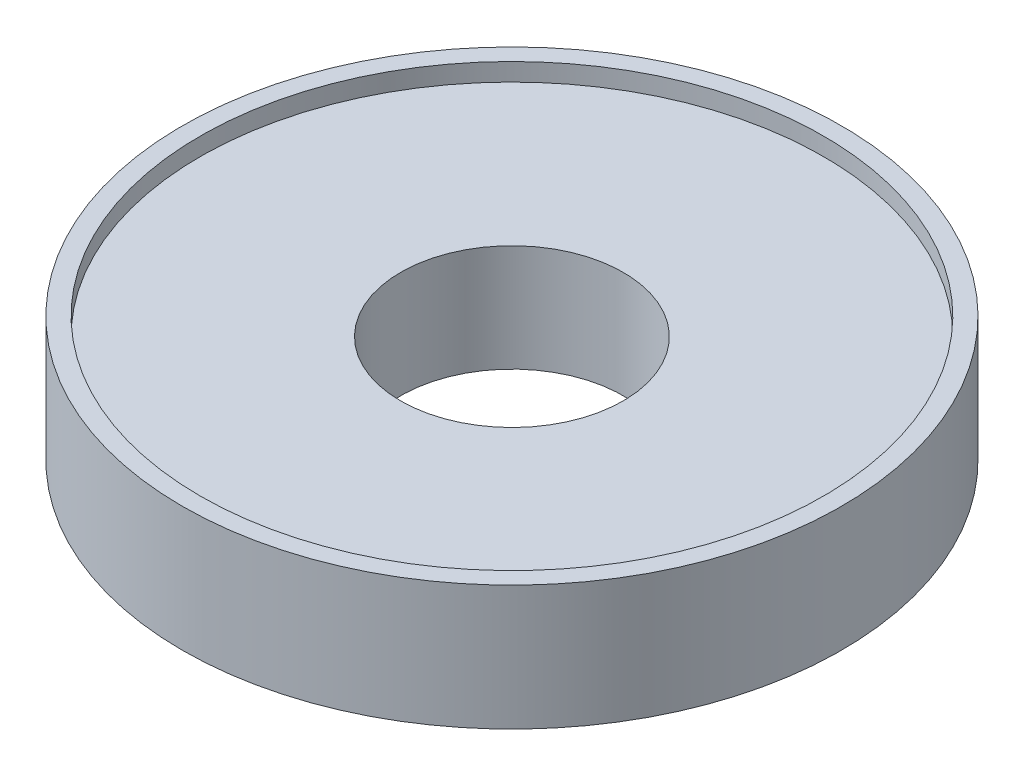
ISO-10303-21;
HEADER;
FILE_DESCRIPTION(('STEP AP214'),'2;1');
FILE_NAME('part.step','',(''),(''),'','','');
FILE_SCHEMA(('AUTOMOTIVE_DESIGN { 1 0 10303 214 1 1 1 1 }'));
ENDSEC;
DATA;
#1=APPLICATION_CONTEXT('core data for automotive mechanical design processes');
#2=APPLICATION_PROTOCOL_DEFINITION('international standard','automotive_design',2000,#1);
#3=PRODUCT_CONTEXT('',#1,'mechanical');
#4=PRODUCT('Part','Part','',(#3));
#5=PRODUCT_RELATED_PRODUCT_CATEGORY('part','',(#4));
#6=PRODUCT_DEFINITION_FORMATION('','',#4);
#7=PRODUCT_DEFINITION_CONTEXT('part definition',#1,'design');
#8=PRODUCT_DEFINITION('design','',#6,#7);
#9=PRODUCT_DEFINITION_SHAPE('','',#8);
#10=(LENGTH_UNIT() NAMED_UNIT(*) SI_UNIT(.MILLI.,.METRE.));
#11=(NAMED_UNIT(*) PLANE_ANGLE_UNIT() SI_UNIT($,.RADIAN.));
#12=(NAMED_UNIT(*) SI_UNIT($,.STERADIAN.) SOLID_ANGLE_UNIT());
#13=UNCERTAINTY_MEASURE_WITH_UNIT(LENGTH_MEASURE(1.E-05),#10,'distance_accuracy_value','');
#14=(GEOMETRIC_REPRESENTATION_CONTEXT(3) GLOBAL_UNCERTAINTY_ASSIGNED_CONTEXT((#13)) GLOBAL_UNIT_ASSIGNED_CONTEXT((#10,
#11,#12)) REPRESENTATION_CONTEXT('',''));
#15=CARTESIAN_POINT('',(0.,0.,0.));
#16=DIRECTION('',(0.,0.,1.));
#17=DIRECTION('',(1.,0.,0.));
#18=AXIS2_PLACEMENT_3D('',#15,#16,#17);
#19=CARTESIAN_POINT('',(0.,6.,0.));
#20=DIRECTION('',(0.,-1.,0.));
#21=DIRECTION('',(0.,0.,-1.));
#22=AXIS2_PLACEMENT_3D('',#19,#20,#21);
#23=CYLINDRICAL_SURFACE('',#22,18.5);
#24=CARTESIAN_POINT('',(0.,0.,0.));
#25=DIRECTION('',(0.,1.,0.));
#26=DIRECTION('',(0.,0.,1.));
#27=AXIS2_PLACEMENT_3D('',#24,#25,#26);
#28=CIRCLE('',#27,18.5);
#29=CARTESIAN_POINT('',(0.,0.,18.5));
#30=VERTEX_POINT('',#29);
#31=EDGE_CURVE('E47',#30,#30,#28,.T.);
#32=ORIENTED_EDGE('',*,*,#31,.T.);
#33=EDGE_LOOP('',(#32));
#34=FACE_BOUND('',#33,.T.);
#35=CARTESIAN_POINT('',(0.,7.,0.));
#36=DIRECTION('',(0.,1.,0.));
#37=DIRECTION('',(0.,0.,1.));
#38=AXIS2_PLACEMENT_3D('',#35,#36,#37);
#39=CIRCLE('',#38,18.5);
#40=CARTESIAN_POINT('',(0.,7.,18.5));
#41=VERTEX_POINT('',#40);
#42=EDGE_CURVE('E51',#41,#41,#39,.T.);
#43=ORIENTED_EDGE('',*,*,#42,.F.);
#44=EDGE_LOOP('',(#43));
#45=FACE_BOUND('',#44,.T.);
#46=ADVANCED_FACE('F41',(#34,#45),#23,.T.);
#47=CARTESIAN_POINT('',(0.,0.,0.));
#48=DIRECTION('',(0.,1.,0.));
#49=DIRECTION('',(0.,0.,1.));
#50=AXIS2_PLACEMENT_3D('',#47,#48,#49);
#51=PLANE('',#50);
#52=CARTESIAN_POINT('',(-10.6066017177982,0.,-10.6066017177982));
#53=DIRECTION('',(0.,-1.,0.));
#54=DIRECTION('',(0.,0.,-1.));
#55=AXIS2_PLACEMENT_3D('',#52,#53,#54);
#56=CIRCLE('',#55,2.25);
#57=CARTESIAN_POINT('',(-10.6066017177982,0.,-12.8566017177982));
#58=VERTEX_POINT('',#57);
#59=EDGE_CURVE('E76',#58,#58,#56,.T.);
#60=ORIENTED_EDGE('',*,*,#59,.F.);
#61=EDGE_LOOP('',(#60));
#62=FACE_BOUND('',#61,.T.);
#63=CARTESIAN_POINT('',(10.6066017177982,0.,-10.6066017177982));
#64=DIRECTION('',(0.,-1.,0.));
#65=DIRECTION('',(0.,0.,-1.));
#66=AXIS2_PLACEMENT_3D('',#63,#64,#65);
#67=CIRCLE('',#66,2.25);
#68=CARTESIAN_POINT('',(10.6066017177982,0.,-12.8566017177982));
#69=VERTEX_POINT('',#68);
#70=EDGE_CURVE('E82',#69,#69,#67,.T.);
#71=ORIENTED_EDGE('',*,*,#70,.F.);
#72=EDGE_LOOP('',(#71));
#73=FACE_BOUND('',#72,.T.);
#74=CARTESIAN_POINT('',(10.6066017177982,0.,10.6066017177982));
#75=DIRECTION('',(0.,-1.,0.));
#76=DIRECTION('',(0.,0.,-1.));
#77=AXIS2_PLACEMENT_3D('',#74,#75,#76);
#78=CIRCLE('',#77,2.25);
#79=CARTESIAN_POINT('',(10.6066017177982,0.,8.35660171779821));
#80=VERTEX_POINT('',#79);
#81=EDGE_CURVE('E70',#80,#80,#78,.T.);
#82=ORIENTED_EDGE('',*,*,#81,.F.);
#83=EDGE_LOOP('',(#82));
#84=FACE_BOUND('',#83,.T.);
#85=CARTESIAN_POINT('',(-10.6066017177982,0.,10.6066017177982));
#86=DIRECTION('',(0.,-1.,0.));
#87=DIRECTION('',(0.,0.,-1.));
#88=AXIS2_PLACEMENT_3D('',#85,#86,#87);
#89=CIRCLE('',#88,2.25);
#90=CARTESIAN_POINT('',(-10.6066017177982,0.,8.35660171779821));
#91=VERTEX_POINT('',#90);
#92=EDGE_CURVE('E67',#91,#91,#89,.T.);
#93=ORIENTED_EDGE('',*,*,#92,.F.);
#94=EDGE_LOOP('',(#93));
#95=FACE_BOUND('',#94,.T.);
#96=CARTESIAN_POINT('',(0.,0.,0.));
#97=DIRECTION('',(0.,1.,0.));
#98=DIRECTION('',(0.,0.,1.));
#99=AXIS2_PLACEMENT_3D('',#96,#97,#98);
#100=CIRCLE('',#99,6.25);
#101=CARTESIAN_POINT('',(0.,0.,6.25));
#102=VERTEX_POINT('',#101);
#103=EDGE_CURVE('E60',#102,#102,#100,.T.);
#104=ORIENTED_EDGE('',*,*,#103,.T.);
#105=EDGE_LOOP('',(#104));
#106=FACE_BOUND('',#105,.T.);
#107=ORIENTED_EDGE('',*,*,#31,.F.);
#108=EDGE_LOOP('',(#107));
#109=FACE_BOUND('',#108,.T.);
#110=ADVANCED_FACE('F93',(#62,#73,#84,#95,#106,#109),#51,.F.);
#111=CARTESIAN_POINT('',(0.,7.,0.));
#112=DIRECTION('',(0.,1.,0.));
#113=DIRECTION('',(0.,0.,1.));
#114=AXIS2_PLACEMENT_3D('',#111,#112,#113);
#115=PLANE('',#114);
#116=ORIENTED_EDGE('',*,*,#42,.T.);
#117=EDGE_LOOP('',(#116));
#118=FACE_BOUND('',#117,.T.);
#119=CARTESIAN_POINT('',(0.,7.,0.));
#120=DIRECTION('',(0.,1.,0.));
#121=DIRECTION('',(0.,0.,1.));
#122=AXIS2_PLACEMENT_3D('',#119,#120,#121);
#123=CIRCLE('',#122,17.5);
#124=CARTESIAN_POINT('',(0.,7.,17.5));
#125=VERTEX_POINT('',#124);
#126=EDGE_CURVE('E55',#125,#125,#123,.T.);
#127=ORIENTED_EDGE('',*,*,#126,.F.);
#128=EDGE_LOOP('',(#127));
#129=FACE_BOUND('',#128,.T.);
#130=ADVANCED_FACE('F96',(#118,#129),#115,.T.);
#131=CARTESIAN_POINT('',(0.,7.,0.));
#132=DIRECTION('',(0.,-1.,0.));
#133=DIRECTION('',(0.,0.,-1.));
#134=AXIS2_PLACEMENT_3D('',#131,#132,#133);
#135=CYLINDRICAL_SURFACE('',#134,17.5);
#136=ORIENTED_EDGE('',*,*,#126,.T.);
#137=EDGE_LOOP('',(#136));
#138=FACE_BOUND('',#137,.T.);
#139=CARTESIAN_POINT('',(0.,6.,0.));
#140=DIRECTION('',(0.,1.,0.));
#141=DIRECTION('',(0.,0.,1.));
#142=AXIS2_PLACEMENT_3D('',#139,#140,#141);
#143=CIRCLE('',#142,17.5);
#144=CARTESIAN_POINT('',(0.,6.,17.5));
#145=VERTEX_POINT('',#144);
#146=EDGE_CURVE('E10',#145,#145,#143,.F.);
#147=ORIENTED_EDGE('',*,*,#146,.T.);
#148=EDGE_LOOP('',(#147));
#149=FACE_BOUND('',#148,.T.);
#150=ADVANCED_FACE('F113',(#138,#149),#135,.F.);
#151=CARTESIAN_POINT('',(0.,6.,0.));
#152=DIRECTION('',(0.,1.,0.));
#153=DIRECTION('',(0.,0.,1.));
#154=AXIS2_PLACEMENT_3D('',#151,#152,#153);
#155=PLANE('',#154);
#156=CARTESIAN_POINT('',(0.,6.,0.));
#157=DIRECTION('',(0.,1.,0.));
#158=DIRECTION('',(0.,0.,1.));
#159=AXIS2_PLACEMENT_3D('',#156,#157,#158);
#160=CIRCLE('',#159,6.24999999999999);
#161=CARTESIAN_POINT('',(0.,6.,6.24999999999999));
#162=VERTEX_POINT('',#161);
#163=EDGE_CURVE('E63',#162,#162,#160,.T.);
#164=ORIENTED_EDGE('',*,*,#163,.F.);
#165=EDGE_LOOP('',(#164));
#166=FACE_BOUND('',#165,.T.);
#167=ORIENTED_EDGE('',*,*,#146,.F.);
#168=EDGE_LOOP('',(#167));
#169=FACE_BOUND('',#168,.T.);
#170=ADVANCED_FACE('F107',(#166,#169),#155,.T.);
#171=CARTESIAN_POINT('',(0.,6.,0.));
#172=DIRECTION('',(0.,1.,0.));
#173=DIRECTION('',(0.,0.,1.));
#174=AXIS2_PLACEMENT_3D('',#171,#172,#173);
#175=CYLINDRICAL_SURFACE('',#174,6.24999999999999);
#176=ORIENTED_EDGE('',*,*,#103,.F.);
#177=EDGE_LOOP('',(#176));
#178=FACE_BOUND('',#177,.T.);
#179=ORIENTED_EDGE('',*,*,#163,.T.);
#180=EDGE_LOOP('',(#179));
#181=FACE_BOUND('',#180,.T.);
#182=ADVANCED_FACE('F103',(#178,#181),#175,.F.);
#183=CARTESIAN_POINT('',(-10.6066017177982,4.,10.6066017177982));
#184=DIRECTION('',(0.,-1.,0.));
#185=DIRECTION('',(0.,0.,-1.));
#186=AXIS2_PLACEMENT_3D('',#183,#184,#185);
#187=CYLINDRICAL_SURFACE('',#186,2.25);
#188=CARTESIAN_POINT('',(-10.6066017177982,4.,10.6066017177982));
#189=DIRECTION('',(0.,-1.,0.));
#190=DIRECTION('',(0.,0.,-1.));
#191=AXIS2_PLACEMENT_3D('',#188,#189,#190);
#192=CIRCLE('',#191,2.25);
#193=CARTESIAN_POINT('',(-10.6066017177982,4.,8.35660171779821));
#194=VERTEX_POINT('',#193);
#195=EDGE_CURVE('E66',#194,#194,#192,.T.);
#196=ORIENTED_EDGE('',*,*,#195,.F.);
#197=EDGE_LOOP('',(#196));
#198=FACE_BOUND('',#197,.T.);
#199=ORIENTED_EDGE('',*,*,#92,.T.);
#200=EDGE_LOOP('',(#199));
#201=FACE_BOUND('',#200,.T.);
#202=ADVANCED_FACE('F106',(#198,#201),#187,.F.);
#203=CARTESIAN_POINT('',(-10.6066017177982,4.,10.6066017177982));
#204=DIRECTION('',(0.,-1.,0.));
#205=DIRECTION('',(0.,0.,-1.));
#206=AXIS2_PLACEMENT_3D('',#203,#204,#205);
#207=PLANE('',#206);
#208=ORIENTED_EDGE('',*,*,#195,.T.);
#209=EDGE_LOOP('',(#208));
#210=FACE_BOUND('',#209,.T.);
#211=ADVANCED_FACE('F135',(#210),#207,.T.);
#212=CARTESIAN_POINT('',(10.6066017177982,4.,10.6066017177982));
#213=DIRECTION('',(0.,-1.,0.));
#214=DIRECTION('',(0.,0.,-1.));
#215=AXIS2_PLACEMENT_3D('',#212,#213,#214);
#216=CYLINDRICAL_SURFACE('',#215,2.25);
#217=CARTESIAN_POINT('',(10.6066017177982,4.,10.6066017177982));
#218=DIRECTION('',(0.,-1.,0.));
#219=DIRECTION('',(0.,0.,-1.));
#220=AXIS2_PLACEMENT_3D('',#217,#218,#219);
#221=CIRCLE('',#220,2.25);
#222=CARTESIAN_POINT('',(10.6066017177982,4.,8.35660171779821));
#223=VERTEX_POINT('',#222);
#224=EDGE_CURVE('E85',#223,#223,#221,.T.);
#225=ORIENTED_EDGE('',*,*,#224,.F.);
#226=EDGE_LOOP('',(#225));
#227=FACE_BOUND('',#226,.T.);
#228=ORIENTED_EDGE('',*,*,#81,.T.);
#229=EDGE_LOOP('',(#228));
#230=FACE_BOUND('',#229,.T.);
#231=ADVANCED_FACE('F91',(#227,#230),#216,.F.);
#232=CARTESIAN_POINT('',(10.6066017177982,4.,10.6066017177982));
#233=DIRECTION('',(0.,-1.,0.));
#234=DIRECTION('',(0.,0.,-1.));
#235=AXIS2_PLACEMENT_3D('',#232,#233,#234);
#236=PLANE('',#235);
#237=ORIENTED_EDGE('',*,*,#224,.T.);
#238=EDGE_LOOP('',(#237));
#239=FACE_BOUND('',#238,.T.);
#240=ADVANCED_FACE('F155',(#239),#236,.T.);
#241=CARTESIAN_POINT('',(10.6066017177982,4.,-10.6066017177982));
#242=DIRECTION('',(0.,-1.,0.));
#243=DIRECTION('',(0.,0.,-1.));
#244=AXIS2_PLACEMENT_3D('',#241,#242,#243);
#245=CYLINDRICAL_SURFACE('',#244,2.25);
#246=CARTESIAN_POINT('',(10.6066017177982,4.,-10.6066017177982));
#247=DIRECTION('',(0.,-1.,0.));
#248=DIRECTION('',(0.,0.,-1.));
#249=AXIS2_PLACEMENT_3D('',#246,#247,#248);
#250=CIRCLE('',#249,2.25);
#251=CARTESIAN_POINT('',(10.6066017177982,4.,-12.8566017177982));
#252=VERTEX_POINT('',#251);
#253=EDGE_CURVE('E79',#252,#252,#250,.T.);
#254=ORIENTED_EDGE('',*,*,#253,.F.);
#255=EDGE_LOOP('',(#254));
#256=FACE_BOUND('',#255,.T.);
#257=ORIENTED_EDGE('',*,*,#70,.T.);
#258=EDGE_LOOP('',(#257));
#259=FACE_BOUND('',#258,.T.);
#260=ADVANCED_FACE('F151',(#256,#259),#245,.F.);
#261=CARTESIAN_POINT('',(10.6066017177982,4.,-10.6066017177982));
#262=DIRECTION('',(0.,-1.,0.));
#263=DIRECTION('',(0.,0.,-1.));
#264=AXIS2_PLACEMENT_3D('',#261,#262,#263);
#265=PLANE('',#264);
#266=ORIENTED_EDGE('',*,*,#253,.T.);
#267=EDGE_LOOP('',(#266));
#268=FACE_BOUND('',#267,.T.);
#269=ADVANCED_FACE('F147',(#268),#265,.T.);
#270=CARTESIAN_POINT('',(-10.6066017177982,4.,-10.6066017177982));
#271=DIRECTION('',(0.,-1.,0.));
#272=DIRECTION('',(0.,0.,-1.));
#273=AXIS2_PLACEMENT_3D('',#270,#271,#272);
#274=CYLINDRICAL_SURFACE('',#273,2.25);
#275=CARTESIAN_POINT('',(-10.6066017177982,4.,-10.6066017177982));
#276=DIRECTION('',(0.,-1.,0.));
#277=DIRECTION('',(0.,0.,-1.));
#278=AXIS2_PLACEMENT_3D('',#275,#276,#277);
#279=CIRCLE('',#278,2.25);
#280=CARTESIAN_POINT('',(-10.6066017177982,4.,-12.8566017177982));
#281=VERTEX_POINT('',#280);
#282=EDGE_CURVE('E73',#281,#281,#279,.T.);
#283=ORIENTED_EDGE('',*,*,#282,.F.);
#284=EDGE_LOOP('',(#283));
#285=FACE_BOUND('',#284,.T.);
#286=ORIENTED_EDGE('',*,*,#59,.T.);
#287=EDGE_LOOP('',(#286));
#288=FACE_BOUND('',#287,.T.);
#289=ADVANCED_FACE('F143',(#285,#288),#274,.F.);
#290=CARTESIAN_POINT('',(-10.6066017177982,4.,-10.6066017177982));
#291=DIRECTION('',(0.,-1.,0.));
#292=DIRECTION('',(0.,0.,-1.));
#293=AXIS2_PLACEMENT_3D('',#290,#291,#292);
#294=PLANE('',#293);
#295=ORIENTED_EDGE('',*,*,#282,.T.);
#296=EDGE_LOOP('',(#295));
#297=FACE_BOUND('',#296,.T.);
#298=ADVANCED_FACE('F140',(#297),#294,.T.);
#299=CLOSED_SHELL('',(#46,#110,#130,#150,#170,#182,#202,#211,#231,#240,#260,#269,#289,#298));
#300=MANIFOLD_SOLID_BREP('B2',#299);
#301=ADVANCED_BREP_SHAPE_REPRESENTATION('',(#18,#300),#14);
#302=SHAPE_DEFINITION_REPRESENTATION(#9,#301);
ENDSEC;
END-ISO-10303-21;
